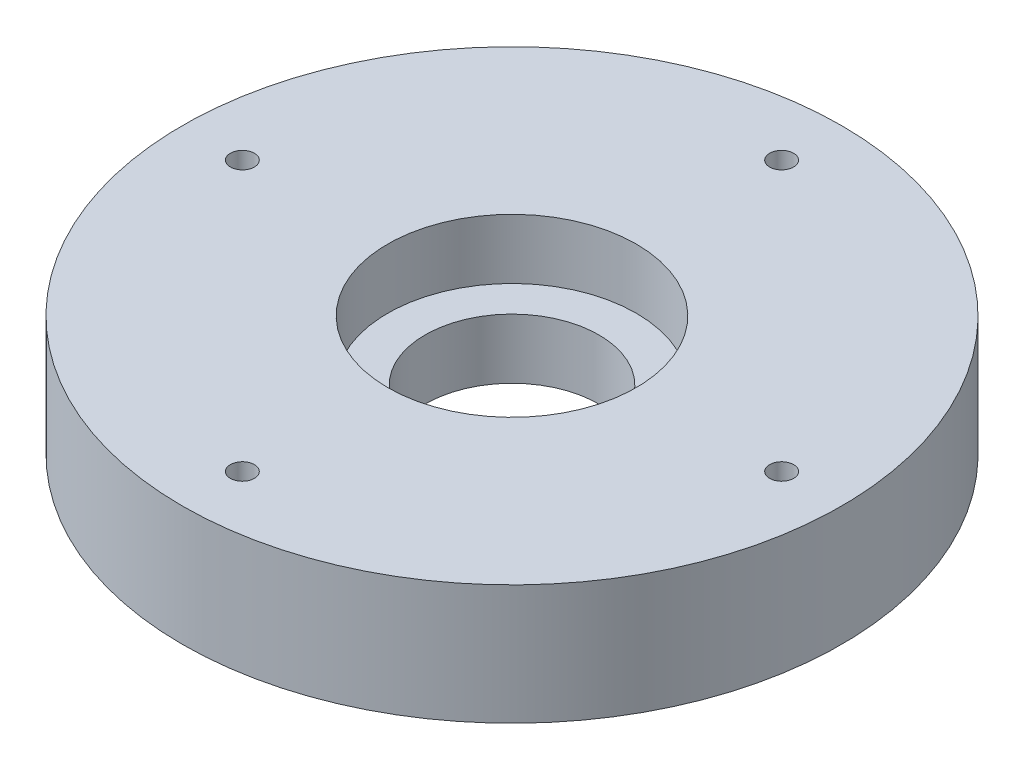
ISO-10303-21;
HEADER;
FILE_DESCRIPTION(('STEP AP214'),'2;1');
FILE_NAME('part.step','',(''),(''),'','','');
FILE_SCHEMA(('AUTOMOTIVE_DESIGN { 1 0 10303 214 1 1 1 1 }'));
ENDSEC;
DATA;
#1=APPLICATION_CONTEXT('core data for automotive mechanical design processes');
#2=APPLICATION_PROTOCOL_DEFINITION('international standard','automotive_design',2000,#1);
#3=PRODUCT_CONTEXT('',#1,'mechanical');
#4=PRODUCT('Part','Part','',(#3));
#5=PRODUCT_RELATED_PRODUCT_CATEGORY('part','',(#4));
#6=PRODUCT_DEFINITION_FORMATION('','',#4);
#7=PRODUCT_DEFINITION_CONTEXT('part definition',#1,'design');
#8=PRODUCT_DEFINITION('design','',#6,#7);
#9=PRODUCT_DEFINITION_SHAPE('','',#8);
#10=(LENGTH_UNIT() NAMED_UNIT(*) SI_UNIT(.MILLI.,.METRE.));
#11=(NAMED_UNIT(*) PLANE_ANGLE_UNIT() SI_UNIT($,.RADIAN.));
#12=(NAMED_UNIT(*) SI_UNIT($,.STERADIAN.) SOLID_ANGLE_UNIT());
#13=UNCERTAINTY_MEASURE_WITH_UNIT(LENGTH_MEASURE(1.E-05),#10,'distance_accuracy_value','');
#14=(GEOMETRIC_REPRESENTATION_CONTEXT(3) GLOBAL_UNCERTAINTY_ASSIGNED_CONTEXT((#13)) GLOBAL_UNIT_ASSIGNED_CONTEXT((#10,
#11,#12)) REPRESENTATION_CONTEXT('',''));
#15=CARTESIAN_POINT('',(0.,0.,0.));
#16=DIRECTION('',(0.,0.,1.));
#17=DIRECTION('',(1.,0.,0.));
#18=AXIS2_PLACEMENT_3D('',#15,#16,#17);
#19=CARTESIAN_POINT('',(0.,0.,-45.));
#20=DIRECTION('',(0.,1.,0.));
#21=DIRECTION('',(0.,0.,1.));
#22=AXIS2_PLACEMENT_3D('',#19,#20,#21);
#23=CYLINDRICAL_SURFACE('',#22,2.);
#24=CARTESIAN_POINT('',(0.,20.,-45.));
#25=DIRECTION('',(0.,1.,0.));
#26=DIRECTION('',(0.,0.,1.));
#27=AXIS2_PLACEMENT_3D('',#24,#25,#26);
#28=CIRCLE('',#27,2.);
#29=CARTESIAN_POINT('',(0.,20.,-43.));
#30=VERTEX_POINT('',#29);
#31=EDGE_CURVE('E81',#30,#30,#28,.T.);
#32=ORIENTED_EDGE('',*,*,#31,.T.);
#33=EDGE_LOOP('',(#32));
#34=FACE_BOUND('',#33,.T.);
#35=CARTESIAN_POINT('',(0.,5.,-45.));
#36=DIRECTION('',(0.,-1.,0.));
#37=DIRECTION('',(0.,0.,-1.));
#38=AXIS2_PLACEMENT_3D('',#35,#36,#37);
#39=CIRCLE('',#38,2.);
#40=CARTESIAN_POINT('',(0.,5.,-47.));
#41=VERTEX_POINT('',#40);
#42=EDGE_CURVE('E36',#41,#41,#39,.F.);
#43=ORIENTED_EDGE('',*,*,#42,.F.);
#44=EDGE_LOOP('',(#43));
#45=FACE_BOUND('',#44,.T.);
#46=ADVANCED_FACE('F32',(#34,#45),#23,.F.);
#47=CARTESIAN_POINT('',(-44.9999999999987,0.,1.27897692436818E-12));
#48=DIRECTION('',(0.,1.,0.));
#49=DIRECTION('',(0.,0.,1.));
#50=AXIS2_PLACEMENT_3D('',#47,#48,#49);
#51=CYLINDRICAL_SURFACE('',#50,2.);
#52=CARTESIAN_POINT('',(-44.9999999999987,20.,1.27897692436818E-12));
#53=DIRECTION('',(0.,1.,0.));
#54=DIRECTION('',(0.,0.,1.));
#55=AXIS2_PLACEMENT_3D('',#52,#53,#54);
#56=CIRCLE('',#55,2.);
#57=CARTESIAN_POINT('',(-44.9999999999987,20.,2.00000000000128));
#58=VERTEX_POINT('',#57);
#59=EDGE_CURVE('E57',#58,#58,#56,.T.);
#60=ORIENTED_EDGE('',*,*,#59,.T.);
#61=EDGE_LOOP('',(#60));
#62=FACE_BOUND('',#61,.T.);
#63=CARTESIAN_POINT('',(-44.9999999999987,5.,1.27897692436818E-12));
#64=DIRECTION('',(0.,-1.,0.));
#65=DIRECTION('',(0.,0.,-1.));
#66=AXIS2_PLACEMENT_3D('',#63,#64,#65);
#67=CIRCLE('',#66,2.);
#68=CARTESIAN_POINT('',(-44.9999999999987,5.,-1.99999999999872));
#69=VERTEX_POINT('',#68);
#70=EDGE_CURVE('E61',#69,#69,#67,.F.);
#71=ORIENTED_EDGE('',*,*,#70,.F.);
#72=EDGE_LOOP('',(#71));
#73=FACE_BOUND('',#72,.T.);
#74=ADVANCED_FACE('F113',(#62,#73),#51,.F.);
#75=CARTESIAN_POINT('',(45.0000000000013,0.,-1.27346601377202E-12));
#76=DIRECTION('',(0.,1.,0.));
#77=DIRECTION('',(0.,0.,1.));
#78=AXIS2_PLACEMENT_3D('',#75,#76,#77);
#79=CYLINDRICAL_SURFACE('',#78,2.);
#80=CARTESIAN_POINT('',(45.0000000000013,20.,-1.27346601377202E-12));
#81=DIRECTION('',(0.,1.,0.));
#82=DIRECTION('',(0.,0.,1.));
#83=AXIS2_PLACEMENT_3D('',#80,#81,#82);
#84=CIRCLE('',#83,2.);
#85=CARTESIAN_POINT('',(45.0000000000013,20.,1.99999999999873));
#86=VERTEX_POINT('',#85);
#87=EDGE_CURVE('E78',#86,#86,#84,.T.);
#88=ORIENTED_EDGE('',*,*,#87,.T.);
#89=EDGE_LOOP('',(#88));
#90=FACE_BOUND('',#89,.T.);
#91=CARTESIAN_POINT('',(45.0000000000013,5.,-1.27346601377202E-12));
#92=DIRECTION('',(0.,-1.,0.));
#93=DIRECTION('',(0.,0.,-1.));
#94=AXIS2_PLACEMENT_3D('',#91,#92,#93);
#95=CIRCLE('',#94,2.);
#96=CARTESIAN_POINT('',(45.0000000000013,5.,-2.00000000000128));
#97=VERTEX_POINT('',#96);
#98=EDGE_CURVE('E59',#97,#97,#95,.F.);
#99=ORIENTED_EDGE('',*,*,#98,.F.);
#100=EDGE_LOOP('',(#99));
#101=FACE_BOUND('',#100,.T.);
#102=ADVANCED_FACE('F119',(#90,#101),#79,.F.);
#103=CARTESIAN_POINT('',(2.54693202754403E-12,0.,45.));
#104=DIRECTION('',(0.,1.,0.));
#105=DIRECTION('',(0.,0.,1.));
#106=AXIS2_PLACEMENT_3D('',#103,#104,#105);
#107=CYLINDRICAL_SURFACE('',#106,2.);
#108=CARTESIAN_POINT('',(2.54693202754403E-12,20.,45.));
#109=DIRECTION('',(0.,1.,0.));
#110=DIRECTION('',(0.,0.,1.));
#111=AXIS2_PLACEMENT_3D('',#108,#109,#110);
#112=CIRCLE('',#111,2.);
#113=CARTESIAN_POINT('',(2.54693202754403E-12,20.,47.));
#114=VERTEX_POINT('',#113);
#115=EDGE_CURVE('E82',#114,#114,#112,.T.);
#116=ORIENTED_EDGE('',*,*,#115,.T.);
#117=EDGE_LOOP('',(#116));
#118=FACE_BOUND('',#117,.T.);
#119=CARTESIAN_POINT('',(2.54693202754403E-12,5.,45.));
#120=DIRECTION('',(0.,-1.,0.));
#121=DIRECTION('',(0.,0.,-1.));
#122=AXIS2_PLACEMENT_3D('',#119,#120,#121);
#123=CIRCLE('',#122,2.);
#124=CARTESIAN_POINT('',(2.54693202754403E-12,5.,43.));
#125=VERTEX_POINT('',#124);
#126=EDGE_CURVE('E54',#125,#125,#123,.F.);
#127=ORIENTED_EDGE('',*,*,#126,.F.);
#128=EDGE_LOOP('',(#127));
#129=FACE_BOUND('',#128,.T.);
#130=ADVANCED_FACE('F107',(#118,#129),#107,.F.);
#131=CARTESIAN_POINT('',(0.,20.,0.));
#132=DIRECTION('',(0.,-1.,0.));
#133=DIRECTION('',(0.,0.,-1.));
#134=AXIS2_PLACEMENT_3D('',#131,#132,#133);
#135=CYLINDRICAL_SURFACE('',#134,14.5);
#136=CARTESIAN_POINT('',(0.,0.,0.));
#137=DIRECTION('',(0.,1.,0.));
#138=DIRECTION('',(0.,0.,1.));
#139=AXIS2_PLACEMENT_3D('',#136,#137,#138);
#140=CIRCLE('',#139,14.5);
#141=CARTESIAN_POINT('',(0.,0.,14.5));
#142=VERTEX_POINT('',#141);
#143=EDGE_CURVE('E45',#142,#142,#140,.T.);
#144=ORIENTED_EDGE('',*,*,#143,.F.);
#145=EDGE_LOOP('',(#144));
#146=FACE_BOUND('',#145,.T.);
#147=CARTESIAN_POINT('',(0.,10.,0.));
#148=DIRECTION('',(0.,1.,0.));
#149=DIRECTION('',(0.,0.,1.));
#150=AXIS2_PLACEMENT_3D('',#147,#148,#149);
#151=CIRCLE('',#150,14.5);
#152=CARTESIAN_POINT('',(0.,10.,14.5));
#153=VERTEX_POINT('',#152);
#154=EDGE_CURVE('E50',#153,#153,#151,.T.);
#155=ORIENTED_EDGE('',*,*,#154,.T.);
#156=EDGE_LOOP('',(#155));
#157=FACE_BOUND('',#156,.T.);
#158=ADVANCED_FACE('F99',(#146,#157),#135,.F.);
#159=CARTESIAN_POINT('',(0.,20.,0.));
#160=DIRECTION('',(0.,1.,0.));
#161=DIRECTION('',(0.,0.,1.));
#162=AXIS2_PLACEMENT_3D('',#159,#160,#161);
#163=PLANE('',#162);
#164=ORIENTED_EDGE('',*,*,#87,.F.);
#165=EDGE_LOOP('',(#164));
#166=FACE_BOUND('',#165,.T.);
#167=ORIENTED_EDGE('',*,*,#115,.F.);
#168=EDGE_LOOP('',(#167));
#169=FACE_BOUND('',#168,.T.);
#170=ORIENTED_EDGE('',*,*,#59,.F.);
#171=EDGE_LOOP('',(#170));
#172=FACE_BOUND('',#171,.T.);
#173=ORIENTED_EDGE('',*,*,#31,.F.);
#174=EDGE_LOOP('',(#173));
#175=FACE_BOUND('',#174,.T.);
#176=CARTESIAN_POINT('',(0.,20.,0.));
#177=DIRECTION('',(0.,1.,0.));
#178=DIRECTION('',(0.,0.,1.));
#179=AXIS2_PLACEMENT_3D('',#176,#177,#178);
#180=CIRCLE('',#179,20.75);
#181=CARTESIAN_POINT('',(0.,20.,20.75));
#182=VERTEX_POINT('',#181);
#183=EDGE_CURVE('E89',#182,#182,#180,.T.);
#184=ORIENTED_EDGE('',*,*,#183,.F.);
#185=EDGE_LOOP('',(#184));
#186=FACE_BOUND('',#185,.T.);
#187=CARTESIAN_POINT('',(0.,20.,0.));
#188=DIRECTION('',(0.,1.,0.));
#189=DIRECTION('',(0.,0.,1.));
#190=AXIS2_PLACEMENT_3D('',#187,#188,#189);
#191=CIRCLE('',#190,55.);
#192=CARTESIAN_POINT('',(0.,20.,55.));
#193=VERTEX_POINT('',#192);
#194=EDGE_CURVE('E10',#193,#193,#191,.T.);
#195=ORIENTED_EDGE('',*,*,#194,.T.);
#196=EDGE_LOOP('',(#195));
#197=FACE_BOUND('',#196,.T.);
#198=ADVANCED_FACE('F96',(#166,#169,#172,#175,#186,#197),#163,.T.);
#199=CARTESIAN_POINT('',(0.,0.,0.));
#200=DIRECTION('',(0.,1.,0.));
#201=DIRECTION('',(0.,0.,1.));
#202=AXIS2_PLACEMENT_3D('',#199,#200,#201);
#203=PLANE('',#202);
#204=CARTESIAN_POINT('',(45.0000000000013,0.,-1.28448783496434E-12));
#205=DIRECTION('',(0.,-1.,0.));
#206=DIRECTION('',(0.,0.,-1.));
#207=AXIS2_PLACEMENT_3D('',#204,#205,#206);
#208=CIRCLE('',#207,5.00000000000099);
#209=CARTESIAN_POINT('',(45.0000000000013,0.,-5.00000000000227));
#210=VERTEX_POINT('',#209);
#211=EDGE_CURVE('E306',#210,#210,#208,.T.);
#212=ORIENTED_EDGE('',*,*,#211,.F.);
#213=EDGE_LOOP('',(#212));
#214=FACE_BOUND('',#213,.T.);
#215=CARTESIAN_POINT('',(0.,0.,-45.));
#216=DIRECTION('',(0.,-1.,0.));
#217=DIRECTION('',(0.,0.,-1.));
#218=AXIS2_PLACEMENT_3D('',#215,#216,#217);
#219=CIRCLE('',#218,5.00000000000271);
#220=CARTESIAN_POINT('',(0.,0.,-50.0000000000027));
#221=VERTEX_POINT('',#220);
#222=EDGE_CURVE('E302',#221,#221,#219,.T.);
#223=ORIENTED_EDGE('',*,*,#222,.F.);
#224=EDGE_LOOP('',(#223));
#225=FACE_BOUND('',#224,.T.);
#226=CARTESIAN_POINT('',(-44.9999999999987,0.,1.27897692436818E-12));
#227=DIRECTION('',(0.,-1.,0.));
#228=DIRECTION('',(0.,0.,-1.));
#229=AXIS2_PLACEMENT_3D('',#226,#227,#228);
#230=CIRCLE('',#229,5.00000000000203);
#231=CARTESIAN_POINT('',(-44.9999999999987,0.,-5.00000000000075));
#232=VERTEX_POINT('',#231);
#233=EDGE_CURVE('E309',#232,#232,#230,.T.);
#234=ORIENTED_EDGE('',*,*,#233,.F.);
#235=EDGE_LOOP('',(#234));
#236=FACE_BOUND('',#235,.T.);
#237=CARTESIAN_POINT('',(2.54693202754403E-12,0.,45.));
#238=DIRECTION('',(0.,-1.,0.));
#239=DIRECTION('',(0.,0.,-1.));
#240=AXIS2_PLACEMENT_3D('',#237,#238,#239);
#241=CIRCLE('',#240,5.);
#242=CARTESIAN_POINT('',(2.54693202754403E-12,0.,40.));
#243=VERTEX_POINT('',#242);
#244=EDGE_CURVE('E67',#243,#243,#241,.T.);
#245=ORIENTED_EDGE('',*,*,#244,.F.);
#246=EDGE_LOOP('',(#245));
#247=FACE_BOUND('',#246,.T.);
#248=CARTESIAN_POINT('',(0.,0.,0.));
#249=DIRECTION('',(0.,1.,0.));
#250=DIRECTION('',(0.,0.,1.));
#251=AXIS2_PLACEMENT_3D('',#248,#249,#250);
#252=CIRCLE('',#251,55.);
#253=CARTESIAN_POINT('',(0.,0.,55.));
#254=VERTEX_POINT('',#253);
#255=EDGE_CURVE('E40',#254,#254,#252,.T.);
#256=ORIENTED_EDGE('',*,*,#255,.F.);
#257=EDGE_LOOP('',(#256));
#258=FACE_BOUND('',#257,.T.);
#259=ORIENTED_EDGE('',*,*,#143,.T.);
#260=EDGE_LOOP('',(#259));
#261=FACE_BOUND('',#260,.T.);
#262=ADVANCED_FACE('F98',(#214,#225,#236,#247,#258,#261),#203,.F.);
#263=CARTESIAN_POINT('',(0.,20.,0.));
#264=DIRECTION('',(0.,-1.,0.));
#265=DIRECTION('',(0.,0.,-1.));
#266=AXIS2_PLACEMENT_3D('',#263,#264,#265);
#267=CYLINDRICAL_SURFACE('',#266,55.);
#268=ORIENTED_EDGE('',*,*,#194,.F.);
#269=EDGE_LOOP('',(#268));
#270=FACE_BOUND('',#269,.T.);
#271=ORIENTED_EDGE('',*,*,#255,.T.);
#272=EDGE_LOOP('',(#271));
#273=FACE_BOUND('',#272,.T.);
#274=ADVANCED_FACE('F34',(#270,#273),#267,.T.);
#275=CARTESIAN_POINT('',(0.,10.,0.));
#276=DIRECTION('',(0.,1.,0.));
#277=DIRECTION('',(0.,0.,1.));
#278=AXIS2_PLACEMENT_3D('',#275,#276,#277);
#279=CYLINDRICAL_SURFACE('',#278,20.75);
#280=CARTESIAN_POINT('',(0.,10.,0.));
#281=DIRECTION('',(0.,1.,0.));
#282=DIRECTION('',(0.,0.,1.));
#283=AXIS2_PLACEMENT_3D('',#280,#281,#282);
#284=CIRCLE('',#283,20.75);
#285=CARTESIAN_POINT('',(0.,10.,20.75));
#286=VERTEX_POINT('',#285);
#287=EDGE_CURVE('E53',#286,#286,#284,.T.);
#288=ORIENTED_EDGE('',*,*,#287,.F.);
#289=EDGE_LOOP('',(#288));
#290=FACE_BOUND('',#289,.T.);
#291=ORIENTED_EDGE('',*,*,#183,.T.);
#292=EDGE_LOOP('',(#291));
#293=FACE_BOUND('',#292,.T.);
#294=ADVANCED_FACE('F94',(#290,#293),#279,.F.);
#295=CARTESIAN_POINT('',(0.,10.,0.));
#296=DIRECTION('',(0.,1.,0.));
#297=DIRECTION('',(0.,0.,1.));
#298=AXIS2_PLACEMENT_3D('',#295,#296,#297);
#299=PLANE('',#298);
#300=ORIENTED_EDGE('',*,*,#154,.F.);
#301=EDGE_LOOP('',(#300));
#302=FACE_BOUND('',#301,.T.);
#303=ORIENTED_EDGE('',*,*,#287,.T.);
#304=EDGE_LOOP('',(#303));
#305=FACE_BOUND('',#304,.T.);
#306=ADVANCED_FACE('F125',(#302,#305),#299,.T.);
#307=CARTESIAN_POINT('',(2.54693202754403E-12,5.,45.));
#308=DIRECTION('',(0.,-1.,0.));
#309=DIRECTION('',(0.,0.,-1.));
#310=AXIS2_PLACEMENT_3D('',#307,#308,#309);
#311=PLANE('',#310);
#312=CARTESIAN_POINT('',(2.54693202754403E-12,5.,45.));
#313=DIRECTION('',(0.,-1.,0.));
#314=DIRECTION('',(0.,0.,-1.));
#315=AXIS2_PLACEMENT_3D('',#312,#313,#314);
#316=CIRCLE('',#315,5.);
#317=CARTESIAN_POINT('',(2.54693202754403E-12,5.,40.));
#318=VERTEX_POINT('',#317);
#319=EDGE_CURVE('E58',#318,#318,#316,.T.);
#320=ORIENTED_EDGE('',*,*,#319,.T.);
#321=EDGE_LOOP('',(#320));
#322=FACE_BOUND('',#321,.T.);
#323=ORIENTED_EDGE('',*,*,#126,.T.);
#324=EDGE_LOOP('',(#323));
#325=FACE_BOUND('',#324,.T.);
#326=ADVANCED_FACE('F128',(#322,#325),#311,.T.);
#327=CARTESIAN_POINT('',(2.54693202754403E-12,5.,45.));
#328=DIRECTION('',(0.,-1.,0.));
#329=DIRECTION('',(0.,0.,-1.));
#330=AXIS2_PLACEMENT_3D('',#327,#328,#329);
#331=CYLINDRICAL_SURFACE('',#330,5.);
#332=ORIENTED_EDGE('',*,*,#319,.F.);
#333=EDGE_LOOP('',(#332));
#334=FACE_BOUND('',#333,.T.);
#335=ORIENTED_EDGE('',*,*,#244,.T.);
#336=EDGE_LOOP('',(#335));
#337=FACE_BOUND('',#336,.T.);
#338=ADVANCED_FACE('F168',(#334,#337),#331,.F.);
#339=CARTESIAN_POINT('',(45.0000000000013,5.,-1.28448783496434E-12));
#340=DIRECTION('',(0.,-1.,0.));
#341=DIRECTION('',(0.,0.,-1.));
#342=AXIS2_PLACEMENT_3D('',#339,#340,#341);
#343=PLANE('',#342);
#344=CARTESIAN_POINT('',(45.0000000000013,5.,-1.28448783496434E-12));
#345=DIRECTION('',(0.,-1.,0.));
#346=DIRECTION('',(0.,0.,-1.));
#347=AXIS2_PLACEMENT_3D('',#344,#345,#346);
#348=CIRCLE('',#347,5.00000000000099);
#349=CARTESIAN_POINT('',(45.0000000000013,5.,-5.00000000000227));
#350=VERTEX_POINT('',#349);
#351=EDGE_CURVE('E62',#350,#350,#348,.T.);
#352=ORIENTED_EDGE('',*,*,#351,.T.);
#353=EDGE_LOOP('',(#352));
#354=FACE_BOUND('',#353,.T.);
#355=ORIENTED_EDGE('',*,*,#98,.T.);
#356=EDGE_LOOP('',(#355));
#357=FACE_BOUND('',#356,.T.);
#358=ADVANCED_FACE('F179',(#354,#357),#343,.T.);
#359=CARTESIAN_POINT('',(45.0000000000013,5.,-1.28448783496434E-12));
#360=DIRECTION('',(0.,-1.,0.));
#361=DIRECTION('',(0.,0.,-1.));
#362=AXIS2_PLACEMENT_3D('',#359,#360,#361);
#363=CYLINDRICAL_SURFACE('',#362,5.00000000000099);
#364=ORIENTED_EDGE('',*,*,#351,.F.);
#365=EDGE_LOOP('',(#364));
#366=FACE_BOUND('',#365,.T.);
#367=ORIENTED_EDGE('',*,*,#211,.T.);
#368=EDGE_LOOP('',(#367));
#369=FACE_BOUND('',#368,.T.);
#370=ADVANCED_FACE('F189',(#366,#369),#363,.F.);
#371=CARTESIAN_POINT('',(-44.9999999999987,5.,1.27897692436818E-12));
#372=DIRECTION('',(0.,-1.,0.));
#373=DIRECTION('',(0.,0.,-1.));
#374=AXIS2_PLACEMENT_3D('',#371,#372,#373);
#375=PLANE('',#374);
#376=CARTESIAN_POINT('',(-44.9999999999987,5.,1.27897692436818E-12));
#377=DIRECTION('',(0.,-1.,0.));
#378=DIRECTION('',(0.,0.,-1.));
#379=AXIS2_PLACEMENT_3D('',#376,#377,#378);
#380=CIRCLE('',#379,5.00000000000203);
#381=CARTESIAN_POINT('',(-44.9999999999987,5.,-5.00000000000075));
#382=VERTEX_POINT('',#381);
#383=EDGE_CURVE('E304',#382,#382,#380,.T.);
#384=ORIENTED_EDGE('',*,*,#383,.T.);
#385=EDGE_LOOP('',(#384));
#386=FACE_BOUND('',#385,.T.);
#387=ORIENTED_EDGE('',*,*,#70,.T.);
#388=EDGE_LOOP('',(#387));
#389=FACE_BOUND('',#388,.T.);
#390=ADVANCED_FACE('F199',(#386,#389),#375,.T.);
#391=CARTESIAN_POINT('',(-44.9999999999987,5.,1.27897692436818E-12));
#392=DIRECTION('',(0.,-1.,0.));
#393=DIRECTION('',(0.,0.,-1.));
#394=AXIS2_PLACEMENT_3D('',#391,#392,#393);
#395=CYLINDRICAL_SURFACE('',#394,5.00000000000203);
#396=ORIENTED_EDGE('',*,*,#383,.F.);
#397=EDGE_LOOP('',(#396));
#398=FACE_BOUND('',#397,.T.);
#399=ORIENTED_EDGE('',*,*,#233,.T.);
#400=EDGE_LOOP('',(#399));
#401=FACE_BOUND('',#400,.T.);
#402=ADVANCED_FACE('F209',(#398,#401),#395,.F.);
#403=CARTESIAN_POINT('',(0.,5.,-45.));
#404=DIRECTION('',(0.,-1.,0.));
#405=DIRECTION('',(0.,0.,-1.));
#406=AXIS2_PLACEMENT_3D('',#403,#404,#405);
#407=PLANE('',#406);
#408=CARTESIAN_POINT('',(0.,5.,-45.));
#409=DIRECTION('',(0.,-1.,0.));
#410=DIRECTION('',(0.,0.,-1.));
#411=AXIS2_PLACEMENT_3D('',#408,#409,#410);
#412=CIRCLE('',#411,5.00000000000271);
#413=CARTESIAN_POINT('',(0.,5.,-50.0000000000027));
#414=VERTEX_POINT('',#413);
#415=EDGE_CURVE('E299',#414,#414,#412,.T.);
#416=ORIENTED_EDGE('',*,*,#415,.T.);
#417=EDGE_LOOP('',(#416));
#418=FACE_BOUND('',#417,.T.);
#419=ORIENTED_EDGE('',*,*,#42,.T.);
#420=EDGE_LOOP('',(#419));
#421=FACE_BOUND('',#420,.T.);
#422=ADVANCED_FACE('F219',(#418,#421),#407,.T.);
#423=CARTESIAN_POINT('',(0.,5.,-45.));
#424=DIRECTION('',(0.,-1.,0.));
#425=DIRECTION('',(0.,0.,-1.));
#426=AXIS2_PLACEMENT_3D('',#423,#424,#425);
#427=CYLINDRICAL_SURFACE('',#426,5.00000000000271);
#428=ORIENTED_EDGE('',*,*,#415,.F.);
#429=EDGE_LOOP('',(#428));
#430=FACE_BOUND('',#429,.T.);
#431=ORIENTED_EDGE('',*,*,#222,.T.);
#432=EDGE_LOOP('',(#431));
#433=FACE_BOUND('',#432,.T.);
#434=ADVANCED_FACE('F229',(#430,#433),#427,.F.);
#435=CLOSED_SHELL('',(#46,#74,#102,#130,#158,#198,#262,#274,#294,#306,#326,#338,#358,#370,#390,
#402,#422,#434));
#436=MANIFOLD_SOLID_BREP('B2',#435);
#437=ADVANCED_BREP_SHAPE_REPRESENTATION('',(#18,#436),#14);
#438=SHAPE_DEFINITION_REPRESENTATION(#9,#437);
ENDSEC;
END-ISO-10303-21;
